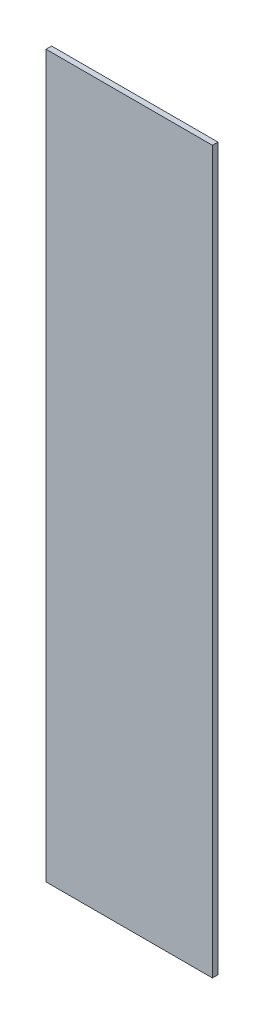
ISO-10303-21;
HEADER;
FILE_DESCRIPTION(('STEP AP214'),'2;1');
FILE_NAME('part.step','',(''),(''),'','','');
FILE_SCHEMA(('AUTOMOTIVE_DESIGN { 1 0 10303 214 1 1 1 1 }'));
ENDSEC;
DATA;
#1=APPLICATION_CONTEXT('core data for automotive mechanical design processes');
#2=APPLICATION_PROTOCOL_DEFINITION('international standard','automotive_design',2000,#1);
#3=PRODUCT_CONTEXT('',#1,'mechanical');
#4=PRODUCT('Part','Part','',(#3));
#5=PRODUCT_RELATED_PRODUCT_CATEGORY('part','',(#4));
#6=PRODUCT_DEFINITION_FORMATION('','',#4);
#7=PRODUCT_DEFINITION_CONTEXT('part definition',#1,'design');
#8=PRODUCT_DEFINITION('design','',#6,#7);
#9=PRODUCT_DEFINITION_SHAPE('','',#8);
#10=(LENGTH_UNIT() NAMED_UNIT(*) SI_UNIT(.MILLI.,.METRE.));
#11=(NAMED_UNIT(*) PLANE_ANGLE_UNIT() SI_UNIT($,.RADIAN.));
#12=(NAMED_UNIT(*) SI_UNIT($,.STERADIAN.) SOLID_ANGLE_UNIT());
#13=UNCERTAINTY_MEASURE_WITH_UNIT(LENGTH_MEASURE(1.E-05),#10,'distance_accuracy_value','');
#14=(GEOMETRIC_REPRESENTATION_CONTEXT(3) GLOBAL_UNCERTAINTY_ASSIGNED_CONTEXT((#13)) GLOBAL_UNIT_ASSIGNED_CONTEXT((#10,
#11,#12)) REPRESENTATION_CONTEXT('',''));
#15=CARTESIAN_POINT('',(0.,0.,0.));
#16=DIRECTION('',(0.,0.,1.));
#17=DIRECTION('',(1.,0.,0.));
#18=AXIS2_PLACEMENT_3D('',#15,#16,#17);
#19=CARTESIAN_POINT('',(0.725,0.,1.15));
#20=DIRECTION('',(0.,0.,1.));
#21=DIRECTION('',(1.,0.,0.));
#22=AXIS2_PLACEMENT_3D('',#19,#20,#21);
#23=PLANE('',#22);
#24=DIRECTION('',(0.,-1.,0.));
#25=VECTOR('',#24,1.);
#26=CARTESIAN_POINT('',(0.875,0.,1.15));
#27=LINE('',#26,#25);
#28=CARTESIAN_POINT('',(0.875,0.65,1.15));
#29=VERTEX_POINT('',#28);
#30=CARTESIAN_POINT('',(0.875,-0.65,1.15));
#31=VERTEX_POINT('',#30);
#32=EDGE_CURVE('E19',#29,#31,#27,.T.);
#33=ORIENTED_EDGE('',*,*,#32,.T.);
#34=DIRECTION('',(-1.,0.,0.));
#35=VECTOR('',#34,1.);
#36=CARTESIAN_POINT('',(0.725,-0.65,1.15));
#37=LINE('',#36,#35);
#38=CARTESIAN_POINT('',(0.575,-0.65,1.15));
#39=VERTEX_POINT('',#38);
#40=EDGE_CURVE('E26',#31,#39,#37,.T.);
#41=ORIENTED_EDGE('',*,*,#40,.T.);
#42=DIRECTION('',(0.,-1.,0.));
#43=VECTOR('',#42,1.);
#44=CARTESIAN_POINT('',(0.575,0.,1.15));
#45=LINE('',#44,#43);
#46=CARTESIAN_POINT('',(0.575,0.65,1.15));
#47=VERTEX_POINT('',#46);
#48=EDGE_CURVE('E68',#47,#39,#45,.T.);
#49=ORIENTED_EDGE('',*,*,#48,.F.);
#50=DIRECTION('',(-1.,0.,0.));
#51=VECTOR('',#50,1.);
#52=CARTESIAN_POINT('',(0.725,0.65,1.15));
#53=LINE('',#52,#51);
#54=EDGE_CURVE('E64',#29,#47,#53,.T.);
#55=ORIENTED_EDGE('',*,*,#54,.F.);
#56=EDGE_LOOP('',(#33,#41,#49,#55));
#57=FACE_BOUND('',#56,.T.);
#58=ADVANCED_FACE('F16',(#57),#23,.F.);
#59=CARTESIAN_POINT('',(0.725,0.,1.16));
#60=DIRECTION('',(0.,0.,1.));
#61=DIRECTION('',(1.,0.,0.));
#62=AXIS2_PLACEMENT_3D('',#59,#60,#61);
#63=PLANE('',#62);
#64=DIRECTION('',(0.,-1.,0.));
#65=VECTOR('',#64,1.);
#66=CARTESIAN_POINT('',(0.875,0.,1.16));
#67=LINE('',#66,#65);
#68=CARTESIAN_POINT('',(0.875,0.65,1.16));
#69=VERTEX_POINT('',#68);
#70=CARTESIAN_POINT('',(0.875,-0.65,1.16));
#71=VERTEX_POINT('',#70);
#72=EDGE_CURVE('E85',#69,#71,#67,.T.);
#73=ORIENTED_EDGE('',*,*,#72,.F.);
#74=DIRECTION('',(-1.,0.,0.));
#75=VECTOR('',#74,1.);
#76=CARTESIAN_POINT('',(0.725,0.65,1.16));
#77=LINE('',#76,#75);
#78=CARTESIAN_POINT('',(0.575,0.65,1.16));
#79=VERTEX_POINT('',#78);
#80=EDGE_CURVE('E80',#69,#79,#77,.T.);
#81=ORIENTED_EDGE('',*,*,#80,.T.);
#82=DIRECTION('',(0.,-1.,0.));
#83=VECTOR('',#82,1.);
#84=CARTESIAN_POINT('',(0.575,0.,1.16));
#85=LINE('',#84,#83);
#86=CARTESIAN_POINT('',(0.575,-0.65,1.16));
#87=VERTEX_POINT('',#86);
#88=EDGE_CURVE('E134',#79,#87,#85,.T.);
#89=ORIENTED_EDGE('',*,*,#88,.T.);
#90=DIRECTION('',(-1.,0.,0.));
#91=VECTOR('',#90,1.);
#92=CARTESIAN_POINT('',(0.725,-0.65,1.16));
#93=LINE('',#92,#91);
#94=EDGE_CURVE('E11',#71,#87,#93,.T.);
#95=ORIENTED_EDGE('',*,*,#94,.F.);
#96=EDGE_LOOP('',(#73,#81,#89,#95));
#97=FACE_BOUND('',#96,.T.);
#98=ADVANCED_FACE('F183',(#97),#63,.T.);
#99=CARTESIAN_POINT('',(0.725,-0.65,1.16));
#100=DIRECTION('',(0.,-1.,0.));
#101=DIRECTION('',(0.,0.,-1.));
#102=AXIS2_PLACEMENT_3D('',#99,#100,#101);
#103=PLANE('',#102);
#104=ORIENTED_EDGE('',*,*,#40,.F.);
#105=DIRECTION('',(0.,0.,-1.));
#106=VECTOR('',#105,1.);
#107=CARTESIAN_POINT('',(0.875,-0.65,1.16));
#108=LINE('',#107,#106);
#109=EDGE_CURVE('E74',#71,#31,#108,.T.);
#110=ORIENTED_EDGE('',*,*,#109,.F.);
#111=ORIENTED_EDGE('',*,*,#94,.T.);
#112=DIRECTION('',(0.,0.,-1.));
#113=VECTOR('',#112,1.);
#114=CARTESIAN_POINT('',(0.575,-0.65,1.16));
#115=LINE('',#114,#113);
#116=EDGE_CURVE('E129',#87,#39,#115,.T.);
#117=ORIENTED_EDGE('',*,*,#116,.T.);
#118=EDGE_LOOP('',(#104,#110,#111,#117));
#119=FACE_BOUND('',#118,.T.);
#120=ADVANCED_FACE('F173',(#119),#103,.T.);
#121=CARTESIAN_POINT('',(0.575,0.,1.16));
#122=DIRECTION('',(1.,0.,0.));
#123=DIRECTION('',(0.,1.,0.));
#124=AXIS2_PLACEMENT_3D('',#121,#122,#123);
#125=PLANE('',#124);
#126=ORIENTED_EDGE('',*,*,#48,.T.);
#127=ORIENTED_EDGE('',*,*,#116,.F.);
#128=ORIENTED_EDGE('',*,*,#88,.F.);
#129=DIRECTION('',(0.,0.,-1.));
#130=VECTOR('',#129,1.);
#131=CARTESIAN_POINT('',(0.575,0.65,1.16));
#132=LINE('',#131,#130);
#133=EDGE_CURVE('E73',#79,#47,#132,.T.);
#134=ORIENTED_EDGE('',*,*,#133,.T.);
#135=EDGE_LOOP('',(#126,#127,#128,#134));
#136=FACE_BOUND('',#135,.T.);
#137=ADVANCED_FACE('F163',(#136),#125,.F.);
#138=CARTESIAN_POINT('',(0.725,0.65,1.16));
#139=DIRECTION('',(0.,-1.,0.));
#140=DIRECTION('',(0.,0.,-1.));
#141=AXIS2_PLACEMENT_3D('',#138,#139,#140);
#142=PLANE('',#141);
#143=ORIENTED_EDGE('',*,*,#54,.T.);
#144=ORIENTED_EDGE('',*,*,#133,.F.);
#145=ORIENTED_EDGE('',*,*,#80,.F.);
#146=DIRECTION('',(0.,0.,-1.));
#147=VECTOR('',#146,1.);
#148=CARTESIAN_POINT('',(0.875,0.65,1.16));
#149=LINE('',#148,#147);
#150=EDGE_CURVE('E77',#69,#29,#149,.T.);
#151=ORIENTED_EDGE('',*,*,#150,.T.);
#152=EDGE_LOOP('',(#143,#144,#145,#151));
#153=FACE_BOUND('',#152,.T.);
#154=ADVANCED_FACE('F78',(#153),#142,.F.);
#155=CARTESIAN_POINT('',(0.875,0.,1.16));
#156=DIRECTION('',(1.,0.,0.));
#157=DIRECTION('',(0.,1.,0.));
#158=AXIS2_PLACEMENT_3D('',#155,#156,#157);
#159=PLANE('',#158);
#160=ORIENTED_EDGE('',*,*,#32,.F.);
#161=ORIENTED_EDGE('',*,*,#150,.F.);
#162=ORIENTED_EDGE('',*,*,#72,.T.);
#163=ORIENTED_EDGE('',*,*,#109,.T.);
#164=EDGE_LOOP('',(#160,#161,#162,#163));
#165=FACE_BOUND('',#164,.T.);
#166=ADVANCED_FACE('F88',(#165),#159,.T.);
#167=CLOSED_SHELL('',(#58,#98,#120,#137,#154,#166));
#168=MANIFOLD_SOLID_BREP('B1',#167);
#169=ADVANCED_BREP_SHAPE_REPRESENTATION('',(#18,#168),#14);
#170=SHAPE_DEFINITION_REPRESENTATION(#9,#169);
ENDSEC;
END-ISO-10303-21;
